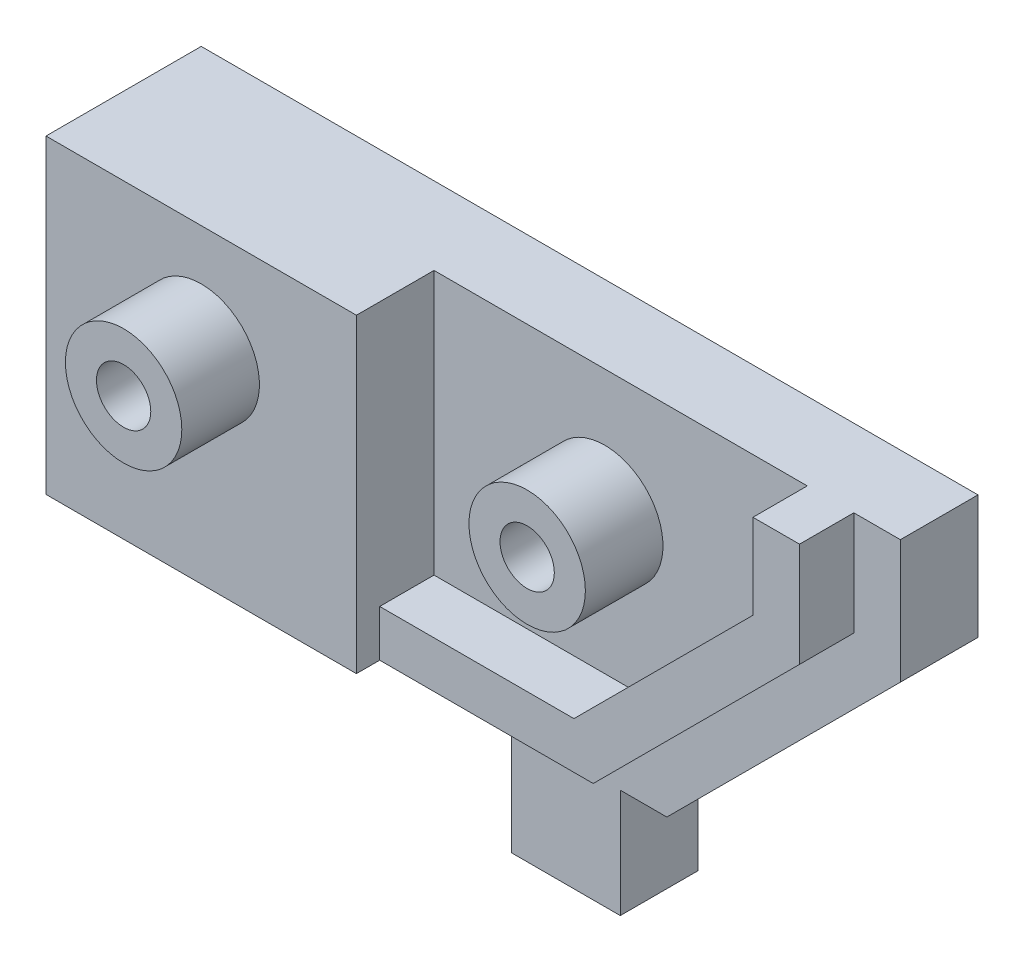
ISO-10303-21;
HEADER;
FILE_DESCRIPTION(('STEP AP214'),'2;1');
FILE_NAME('part.step','',(''),(''),'','','');
FILE_SCHEMA(('AUTOMOTIVE_DESIGN { 1 0 10303 214 1 1 1 1 }'));
ENDSEC;
DATA;
#1=APPLICATION_CONTEXT('core data for automotive mechanical design processes');
#2=APPLICATION_PROTOCOL_DEFINITION('international standard','automotive_design',2000,#1);
#3=PRODUCT_CONTEXT('',#1,'mechanical');
#4=PRODUCT('Part','Part','',(#3));
#5=PRODUCT_RELATED_PRODUCT_CATEGORY('part','',(#4));
#6=PRODUCT_DEFINITION_FORMATION('','',#4);
#7=PRODUCT_DEFINITION_CONTEXT('part definition',#1,'design');
#8=PRODUCT_DEFINITION('design','',#6,#7);
#9=PRODUCT_DEFINITION_SHAPE('','',#8);
#10=(LENGTH_UNIT() NAMED_UNIT(*) SI_UNIT(.MILLI.,.METRE.));
#11=(NAMED_UNIT(*) PLANE_ANGLE_UNIT() SI_UNIT($,.RADIAN.));
#12=(NAMED_UNIT(*) SI_UNIT($,.STERADIAN.) SOLID_ANGLE_UNIT());
#13=UNCERTAINTY_MEASURE_WITH_UNIT(LENGTH_MEASURE(1.E-05),#10,'distance_accuracy_value','');
#14=(GEOMETRIC_REPRESENTATION_CONTEXT(3) GLOBAL_UNCERTAINTY_ASSIGNED_CONTEXT((#13)) GLOBAL_UNIT_ASSIGNED_CONTEXT((#10,
#11,#12)) REPRESENTATION_CONTEXT('',''));
#15=CARTESIAN_POINT('',(0.,0.,0.));
#16=DIRECTION('',(0.,0.,1.));
#17=DIRECTION('',(1.,0.,0.));
#18=AXIS2_PLACEMENT_3D('',#15,#16,#17);
#19=CARTESIAN_POINT('',(-35.,23.,5.));
#20=DIRECTION('',(1.,0.,0.));
#21=DIRECTION('',(0.,0.,-1.));
#22=AXIS2_PLACEMENT_3D('',#19,#20,#21);
#23=PLANE('',#22);
#24=DIRECTION('',(0.,1.,0.));
#25=VECTOR('',#24,1.);
#26=CARTESIAN_POINT('',(-35.,3.,5.00000000000001));
#27=LINE('',#26,#25);
#28=CARTESIAN_POINT('',(-35.,0.,5.00000000000001));
#29=VERTEX_POINT('',#28);
#30=CARTESIAN_POINT('',(-35.,3.,5.00000000000001));
#31=VERTEX_POINT('',#30);
#32=EDGE_CURVE('E201',#29,#31,#27,.T.);
#33=ORIENTED_EDGE('',*,*,#32,.T.);
#34=DIRECTION('',(0.,0.,-1.));
#35=VECTOR('',#34,1.);
#36=CARTESIAN_POINT('',(-35.,3.,5.00000000000001));
#37=LINE('',#36,#35);
#38=CARTESIAN_POINT('',(-35.,3.,10.));
#39=VERTEX_POINT('',#38);
#40=EDGE_CURVE('E246',#39,#31,#37,.T.);
#41=ORIENTED_EDGE('',*,*,#40,.F.);
#42=DIRECTION('',(0.,-1.,0.));
#43=VECTOR('',#42,1.);
#44=CARTESIAN_POINT('',(-35.,23.,10.));
#45=LINE('',#44,#43);
#46=CARTESIAN_POINT('',(-35.,23.,10.));
#47=VERTEX_POINT('',#46);
#48=EDGE_CURVE('E199',#47,#39,#45,.T.);
#49=ORIENTED_EDGE('',*,*,#48,.F.);
#50=DIRECTION('',(0.,0.,1.));
#51=VECTOR('',#50,1.);
#52=CARTESIAN_POINT('',(-35.,23.,5.));
#53=LINE('',#52,#51);
#54=CARTESIAN_POINT('',(-35.,23.,0.));
#55=VERTEX_POINT('',#54);
#56=EDGE_CURVE('E417',#55,#47,#53,.T.);
#57=ORIENTED_EDGE('',*,*,#56,.F.);
#58=DIRECTION('',(0.,-1.,0.));
#59=VECTOR('',#58,1.);
#60=CARTESIAN_POINT('',(-35.,23.,0.));
#61=LINE('',#60,#59);
#62=CARTESIAN_POINT('',(-35.,0.,0.));
#63=VERTEX_POINT('',#62);
#64=EDGE_CURVE('E211',#55,#63,#61,.T.);
#65=ORIENTED_EDGE('',*,*,#64,.T.);
#66=DIRECTION('',(0.,0.,1.));
#67=VECTOR('',#66,1.);
#68=CARTESIAN_POINT('',(-35.,0.,5.));
#69=LINE('',#68,#67);
#70=EDGE_CURVE('E248',#63,#29,#69,.T.);
#71=ORIENTED_EDGE('',*,*,#70,.T.);
#72=EDGE_LOOP('',(#33,#41,#49,#57,#65,#71));
#73=FACE_BOUND('',#72,.T.);
#74=ADVANCED_FACE('F44',(#73),#23,.F.);
#75=CARTESIAN_POINT('',(0.,0.,0.));
#76=DIRECTION('',(0.,-1.,0.));
#77=DIRECTION('',(0.,0.,-1.));
#78=AXIS2_PLACEMENT_3D('',#75,#76,#77);
#79=PLANE('',#78);
#80=CARTESIAN_POINT('',(-25.,0.,2.5));
#81=DIRECTION('',(0.,-1.,0.));
#82=DIRECTION('',(0.,0.,-1.));
#83=AXIS2_PLACEMENT_3D('',#80,#81,#82);
#84=CIRCLE('',#83,1.5);
#85=CARTESIAN_POINT('',(-25.,0.,0.999999999999999));
#86=VERTEX_POINT('',#85);
#87=EDGE_CURVE('E397',#86,#86,#84,.T.);
#88=ORIENTED_EDGE('',*,*,#87,.F.);
#89=EDGE_LOOP('',(#88));
#90=FACE_BOUND('',#89,.T.);
#91=DIRECTION('',(1.,0.,0.));
#92=VECTOR('',#91,1.);
#93=CARTESIAN_POINT('',(0.,0.,5.));
#94=LINE('',#93,#92);
#95=CARTESIAN_POINT('',(-10.,0.,5.));
#96=VERTEX_POINT('',#95);
#97=EDGE_CURVE('E418',#29,#96,#94,.T.);
#98=ORIENTED_EDGE('',*,*,#97,.F.);
#99=ORIENTED_EDGE('',*,*,#70,.F.);
#100=DIRECTION('',(-1.,0.,0.));
#101=VECTOR('',#100,1.);
#102=CARTESIAN_POINT('',(-35.,0.,0.));
#103=LINE('',#102,#101);
#104=CARTESIAN_POINT('',(-10.,0.,0.));
#105=VERTEX_POINT('',#104);
#106=EDGE_CURVE('E433',#105,#63,#103,.T.);
#107=ORIENTED_EDGE('',*,*,#106,.F.);
#108=DIRECTION('',(0.,0.,-1.));
#109=VECTOR('',#108,1.);
#110=CARTESIAN_POINT('',(-10.,0.,0.));
#111=LINE('',#110,#109);
#112=EDGE_CURVE('E367',#96,#105,#111,.T.);
#113=ORIENTED_EDGE('',*,*,#112,.F.);
#114=EDGE_LOOP('',(#98,#99,#107,#113));
#115=FACE_BOUND('',#114,.T.);
#116=ADVANCED_FACE('F233',(#90,#115),#79,.T.);
#117=CARTESIAN_POINT('',(0.,23.,5.));
#118=DIRECTION('',(0.,0.,-1.));
#119=DIRECTION('',(-1.,0.,0.));
#120=AXIS2_PLACEMENT_3D('',#117,#118,#119);
#121=PLANE('',#120);
#122=CARTESIAN_POINT('',(-4.,15.,5.));
#123=DIRECTION('',(0.,0.,-1.));
#124=DIRECTION('',(-1.,0.,0.));
#125=AXIS2_PLACEMENT_3D('',#122,#123,#124);
#126=CIRCLE('',#125,3.75);
#127=CARTESIAN_POINT('',(-7.75,15.,5.));
#128=VERTEX_POINT('',#127);
#129=EDGE_CURVE('E11',#128,#128,#126,.F.);
#130=ORIENTED_EDGE('',*,*,#129,.F.);
#131=EDGE_LOOP('',(#130));
#132=FACE_BOUND('',#131,.T.);
#133=DIRECTION('',(0.,-1.,0.));
#134=VECTOR('',#133,1.);
#135=CARTESIAN_POINT('',(9.04723230364965,23.,5.));
#136=LINE('',#135,#134);
#137=CARTESIAN_POINT('',(9.04723230364965,23.,5.));
#138=VERTEX_POINT('',#137);
#139=CARTESIAN_POINT('',(9.04723230364965,17.5325136778882,5.));
#140=VERTEX_POINT('',#139);
#141=EDGE_CURVE('E254',#138,#140,#136,.T.);
#142=ORIENTED_EDGE('',*,*,#141,.F.);
#143=DIRECTION('',(1.,0.,0.));
#144=VECTOR('',#143,1.);
#145=CARTESIAN_POINT('',(0.,23.,5.));
#146=LINE('',#145,#144);
#147=CARTESIAN_POINT('',(-15.,23.,5.));
#148=VERTEX_POINT('',#147);
#149=EDGE_CURVE('E214',#148,#138,#146,.T.);
#150=ORIENTED_EDGE('',*,*,#149,.F.);
#151=DIRECTION('',(0.,-1.,0.));
#152=VECTOR('',#151,1.);
#153=CARTESIAN_POINT('',(-15.,23.,5.));
#154=LINE('',#153,#152);
#155=CARTESIAN_POINT('',(-15.,6.,5.));
#156=VERTEX_POINT('',#155);
#157=EDGE_CURVE('E207',#148,#156,#154,.T.);
#158=ORIENTED_EDGE('',*,*,#157,.T.);
#159=DIRECTION('',(-1.,0.,0.));
#160=VECTOR('',#159,1.);
#161=CARTESIAN_POINT('',(-2.48528137423857,6.,5.));
#162=LINE('',#161,#160);
#163=CARTESIAN_POINT('',(-2.48528137423857,6.,5.));
#164=VERTEX_POINT('',#163);
#165=EDGE_CURVE('E287',#164,#156,#162,.T.);
#166=ORIENTED_EDGE('',*,*,#165,.F.);
#167=DIRECTION('',(-0.707106781186548,-0.707106781186547,0.));
#168=VECTOR('',#167,1.);
#169=CARTESIAN_POINT('',(9.04723230364965,17.5325136778882,5.));
#170=LINE('',#169,#168);
#171=EDGE_CURVE('E284',#140,#164,#170,.T.);
#172=ORIENTED_EDGE('',*,*,#171,.F.);
#173=EDGE_LOOP('',(#142,#150,#158,#166,#172));
#174=FACE_BOUND('',#173,.T.);
#175=ADVANCED_FACE('F241',(#132,#174),#121,.F.);
#176=DIRECTION('',(1.,0.,0.));
#177=VECTOR('',#176,1.);
#178=CARTESIAN_POINT('',(-1.24264068711928,3.,5.));
#179=LINE('',#178,#177);
#180=CARTESIAN_POINT('',(-1.24264068711928,3.,5.));
#181=VERTEX_POINT('',#180);
#182=EDGE_CURVE('E290',#31,#181,#179,.T.);
#183=ORIENTED_EDGE('',*,*,#182,.F.);
#184=ORIENTED_EDGE('',*,*,#32,.F.);
#185=ORIENTED_EDGE('',*,*,#97,.T.);
#186=DIRECTION('',(0.,1.,0.));
#187=VECTOR('',#186,1.);
#188=CARTESIAN_POINT('',(-10.,-7.,5.));
#189=LINE('',#188,#187);
#190=CARTESIAN_POINT('',(-10.,-7.,5.));
#191=VERTEX_POINT('',#190);
#192=EDGE_CURVE('E389',#191,#96,#189,.T.);
#193=ORIENTED_EDGE('',*,*,#192,.F.);
#194=DIRECTION('',(-1.,0.,0.));
#195=VECTOR('',#194,1.);
#196=CARTESIAN_POINT('',(-10.,-7.,5.));
#197=LINE('',#196,#195);
#198=CARTESIAN_POINT('',(-3.,-7.,5.));
#199=VERTEX_POINT('',#198);
#200=EDGE_CURVE('E366',#199,#191,#197,.T.);
#201=ORIENTED_EDGE('',*,*,#200,.F.);
#202=DIRECTION('',(0.,1.,0.));
#203=VECTOR('',#202,1.);
#204=CARTESIAN_POINT('',(-3.,-7.,5.));
#205=LINE('',#204,#203);
#206=CARTESIAN_POINT('',(-3.,0.,5.));
#207=VERTEX_POINT('',#206);
#208=EDGE_CURVE('E393',#199,#207,#205,.T.);
#209=ORIENTED_EDGE('',*,*,#208,.T.);
#210=CARTESIAN_POINT('',(0.,0.,5.));
#211=VERTEX_POINT('',#210);
#212=EDGE_CURVE('E438',#207,#211,#94,.T.);
#213=ORIENTED_EDGE('',*,*,#212,.T.);
#214=DIRECTION('',(0.707106781186544,0.707106781186551,0.));
#215=VECTOR('',#214,1.);
#216=CARTESIAN_POINT('',(15.0472323036496,15.0472323036498,5.));
#217=LINE('',#216,#215);
#218=CARTESIAN_POINT('',(15.0472323036496,15.0472323036498,5.));
#219=VERTEX_POINT('',#218);
#220=EDGE_CURVE('E323',#211,#219,#217,.T.);
#221=ORIENTED_EDGE('',*,*,#220,.T.);
#222=DIRECTION('',(0.,1.,0.));
#223=VECTOR('',#222,1.);
#224=CARTESIAN_POINT('',(15.0472323036496,23.,5.));
#225=LINE('',#224,#223);
#226=CARTESIAN_POINT('',(15.0472323036496,23.,5.));
#227=VERTEX_POINT('',#226);
#228=EDGE_CURVE('E329',#219,#227,#225,.T.);
#229=ORIENTED_EDGE('',*,*,#228,.T.);
#230=CARTESIAN_POINT('',(12.0472323036496,23.,5.));
#231=VERTEX_POINT('',#230);
#232=EDGE_CURVE('E426',#231,#227,#146,.T.);
#233=ORIENTED_EDGE('',*,*,#232,.F.);
#234=DIRECTION('',(0.,1.,0.));
#235=VECTOR('',#234,1.);
#236=CARTESIAN_POINT('',(12.0472323036496,23.,5.));
#237=LINE('',#236,#235);
#238=CARTESIAN_POINT('',(12.0472323036496,16.2898729907689,5.));
#239=VERTEX_POINT('',#238);
#240=EDGE_CURVE('E262',#239,#231,#237,.T.);
#241=ORIENTED_EDGE('',*,*,#240,.F.);
#242=DIRECTION('',(0.707106781186547,0.707106781186548,0.));
#243=VECTOR('',#242,1.);
#244=CARTESIAN_POINT('',(12.0472323036496,16.2898729907689,5.));
#245=LINE('',#244,#243);
#246=EDGE_CURVE('E293',#181,#239,#245,.T.);
#247=ORIENTED_EDGE('',*,*,#246,.F.);
#248=EDGE_LOOP('',(#183,#184,#185,#193,#201,#209,#213,#221,#229,#233,#241,#247));
#249=FACE_BOUND('',#248,.T.);
#250=ADVANCED_FACE('F234',(#249),#121,.F.);
#251=CARTESIAN_POINT('',(-15.,23.,5.));
#252=DIRECTION('',(-1.,0.,0.));
#253=DIRECTION('',(0.,0.,1.));
#254=AXIS2_PLACEMENT_3D('',#251,#252,#253);
#255=PLANE('',#254);
#256=DIRECTION('',(0.,-1.,0.));
#257=VECTOR('',#256,1.);
#258=CARTESIAN_POINT('',(-15.,23.,10.));
#259=LINE('',#258,#257);
#260=CARTESIAN_POINT('',(-15.,23.,10.));
#261=VERTEX_POINT('',#260);
#262=CARTESIAN_POINT('',(-15.,3.,10.));
#263=VERTEX_POINT('',#262);
#264=EDGE_CURVE('E196',#261,#263,#259,.T.);
#265=ORIENTED_EDGE('',*,*,#264,.T.);
#266=DIRECTION('',(0.,0.,1.));
#267=VECTOR('',#266,1.);
#268=CARTESIAN_POINT('',(-15.,3.,5.));
#269=LINE('',#268,#267);
#270=CARTESIAN_POINT('',(-15.,3.,8.5));
#271=VERTEX_POINT('',#270);
#272=EDGE_CURVE('E176',#271,#263,#269,.T.);
#273=ORIENTED_EDGE('',*,*,#272,.F.);
#274=DIRECTION('',(0.,-1.,0.));
#275=VECTOR('',#274,1.);
#276=CARTESIAN_POINT('',(-15.,6.,8.5));
#277=LINE('',#276,#275);
#278=CARTESIAN_POINT('',(-15.,6.,8.5));
#279=VERTEX_POINT('',#278);
#280=EDGE_CURVE('E271',#279,#271,#277,.T.);
#281=ORIENTED_EDGE('',*,*,#280,.F.);
#282=DIRECTION('',(0.,0.,-1.));
#283=VECTOR('',#282,1.);
#284=CARTESIAN_POINT('',(-15.,6.,8.5));
#285=LINE('',#284,#283);
#286=EDGE_CURVE('E308',#279,#156,#285,.T.);
#287=ORIENTED_EDGE('',*,*,#286,.T.);
#288=ORIENTED_EDGE('',*,*,#157,.F.);
#289=DIRECTION('',(0.,0.,-1.));
#290=VECTOR('',#289,1.);
#291=CARTESIAN_POINT('',(-15.,23.,5.));
#292=LINE('',#291,#290);
#293=EDGE_CURVE('E205',#261,#148,#292,.T.);
#294=ORIENTED_EDGE('',*,*,#293,.F.);
#295=EDGE_LOOP('',(#265,#273,#281,#287,#288,#294));
#296=FACE_BOUND('',#295,.T.);
#297=ADVANCED_FACE('F203',(#296),#255,.F.);
#298=CARTESIAN_POINT('',(-15.,23.,10.));
#299=DIRECTION('',(0.,0.,-1.));
#300=DIRECTION('',(-1.,0.,0.));
#301=AXIS2_PLACEMENT_3D('',#298,#299,#300);
#302=PLANE('',#301);
#303=ORIENTED_EDGE('',*,*,#48,.T.);
#304=DIRECTION('',(1.,0.,0.));
#305=VECTOR('',#304,1.);
#306=CARTESIAN_POINT('',(-40.8309518948453,3.,10.));
#307=LINE('',#306,#305);
#308=EDGE_CURVE('E180',#39,#263,#307,.T.);
#309=ORIENTED_EDGE('',*,*,#308,.T.);
#310=ORIENTED_EDGE('',*,*,#264,.F.);
#311=DIRECTION('',(1.,0.,0.));
#312=VECTOR('',#311,1.);
#313=CARTESIAN_POINT('',(-15.,23.,10.));
#314=LINE('',#313,#312);
#315=EDGE_CURVE('E421',#47,#261,#314,.T.);
#316=ORIENTED_EDGE('',*,*,#315,.F.);
#317=EDGE_LOOP('',(#303,#309,#310,#316));
#318=FACE_BOUND('',#317,.T.);
#319=CARTESIAN_POINT('',(-25.,16.,10.));
#320=DIRECTION('',(0.,0.,-1.));
#321=DIRECTION('',(-1.,0.,0.));
#322=AXIS2_PLACEMENT_3D('',#319,#320,#321);
#323=CIRCLE('',#322,3.75);
#324=CARTESIAN_POINT('',(-28.75,16.,10.));
#325=VERTEX_POINT('',#324);
#326=EDGE_CURVE('E53',#325,#325,#323,.F.);
#327=ORIENTED_EDGE('',*,*,#326,.F.);
#328=EDGE_LOOP('',(#327));
#329=FACE_BOUND('',#328,.T.);
#330=ADVANCED_FACE('F193',(#318,#329),#302,.F.);
#331=DIRECTION('',(0.,0.,1.));
#332=VECTOR('',#331,1.);
#333=CARTESIAN_POINT('',(-3.,0.,0.));
#334=LINE('',#333,#332);
#335=CARTESIAN_POINT('',(-3.,0.,0.));
#336=VERTEX_POINT('',#335);
#337=EDGE_CURVE('E68',#336,#207,#334,.T.);
#338=ORIENTED_EDGE('',*,*,#337,.F.);
#339=CARTESIAN_POINT('',(0.,0.,0.));
#340=VERTEX_POINT('',#339);
#341=EDGE_CURVE('E434',#340,#336,#103,.T.);
#342=ORIENTED_EDGE('',*,*,#341,.F.);
#343=DIRECTION('',(0.,0.,-1.));
#344=VECTOR('',#343,1.);
#345=CARTESIAN_POINT('',(0.,0.,0.));
#346=LINE('',#345,#344);
#347=EDGE_CURVE('E410',#211,#340,#346,.T.);
#348=ORIENTED_EDGE('',*,*,#347,.F.);
#349=ORIENTED_EDGE('',*,*,#212,.F.);
#350=EDGE_LOOP('',(#338,#342,#348,#349));
#351=FACE_BOUND('',#350,.T.);
#352=ADVANCED_FACE('F226',(#351),#79,.T.);
#353=CARTESIAN_POINT('',(-35.,23.,0.));
#354=DIRECTION('',(0.,0.,1.));
#355=DIRECTION('',(1.,0.,0.));
#356=AXIS2_PLACEMENT_3D('',#353,#354,#355);
#357=PLANE('',#356);
#358=CARTESIAN_POINT('',(-25.,16.,0.));
#359=DIRECTION('',(0.,0.,1.));
#360=DIRECTION('',(1.,0.,0.));
#361=AXIS2_PLACEMENT_3D('',#358,#359,#360);
#362=CIRCLE('',#361,1.75);
#363=CARTESIAN_POINT('',(-23.25,16.,0.));
#364=VERTEX_POINT('',#363);
#365=EDGE_CURVE('E406',#364,#364,#362,.T.);
#366=ORIENTED_EDGE('',*,*,#365,.T.);
#367=EDGE_LOOP('',(#366));
#368=FACE_BOUND('',#367,.T.);
#369=CARTESIAN_POINT('',(-4.,15.,0.));
#370=DIRECTION('',(0.,0.,1.));
#371=DIRECTION('',(1.,0.,0.));
#372=AXIS2_PLACEMENT_3D('',#369,#370,#371);
#373=CIRCLE('',#372,1.75);
#374=CARTESIAN_POINT('',(-2.25,15.,0.));
#375=VERTEX_POINT('',#374);
#376=EDGE_CURVE('E402',#375,#375,#373,.T.);
#377=ORIENTED_EDGE('',*,*,#376,.T.);
#378=EDGE_LOOP('',(#377));
#379=FACE_BOUND('',#378,.T.);
#380=ORIENTED_EDGE('',*,*,#341,.T.);
#381=DIRECTION('',(0.,1.,0.));
#382=VECTOR('',#381,1.);
#383=CARTESIAN_POINT('',(-3.,-7.,0.));
#384=LINE('',#383,#382);
#385=CARTESIAN_POINT('',(-3.,-7.,0.));
#386=VERTEX_POINT('',#385);
#387=EDGE_CURVE('E376',#386,#336,#384,.T.);
#388=ORIENTED_EDGE('',*,*,#387,.F.);
#389=DIRECTION('',(1.,0.,0.));
#390=VECTOR('',#389,1.);
#391=CARTESIAN_POINT('',(-10.,-7.,0.));
#392=LINE('',#391,#390);
#393=CARTESIAN_POINT('',(-10.,-7.,0.));
#394=VERTEX_POINT('',#393);
#395=EDGE_CURVE('E373',#394,#386,#392,.T.);
#396=ORIENTED_EDGE('',*,*,#395,.F.);
#397=DIRECTION('',(0.,1.,0.));
#398=VECTOR('',#397,1.);
#399=CARTESIAN_POINT('',(-10.,-7.,0.));
#400=LINE('',#399,#398);
#401=EDGE_CURVE('E385',#394,#105,#400,.T.);
#402=ORIENTED_EDGE('',*,*,#401,.T.);
#403=ORIENTED_EDGE('',*,*,#106,.T.);
#404=ORIENTED_EDGE('',*,*,#64,.F.);
#405=DIRECTION('',(-1.,0.,0.));
#406=VECTOR('',#405,1.);
#407=CARTESIAN_POINT('',(0.,23.,0.));
#408=LINE('',#407,#406);
#409=CARTESIAN_POINT('',(15.0472323036496,23.,0.));
#410=VERTEX_POINT('',#409);
#411=EDGE_CURVE('E414',#410,#55,#408,.T.);
#412=ORIENTED_EDGE('',*,*,#411,.F.);
#413=DIRECTION('',(0.,1.,0.));
#414=VECTOR('',#413,1.);
#415=CARTESIAN_POINT('',(15.0472323036496,23.,0.));
#416=LINE('',#415,#414);
#417=CARTESIAN_POINT('',(15.0472323036496,15.0472323036498,0.));
#418=VERTEX_POINT('',#417);
#419=EDGE_CURVE('E328',#418,#410,#416,.T.);
#420=ORIENTED_EDGE('',*,*,#419,.F.);
#421=DIRECTION('',(0.707106781186544,0.707106781186551,0.));
#422=VECTOR('',#421,1.);
#423=CARTESIAN_POINT('',(15.0472323036496,15.0472323036498,0.));
#424=LINE('',#423,#422);
#425=EDGE_CURVE('E324',#340,#418,#424,.T.);
#426=ORIENTED_EDGE('',*,*,#425,.F.);
#427=EDGE_LOOP('',(#380,#388,#396,#402,#403,#404,#412,#420,#426));
#428=FACE_BOUND('',#427,.T.);
#429=ADVANCED_FACE('F46',(#368,#379,#428),#357,.F.);
#430=CARTESIAN_POINT('',(0.,23.,0.));
#431=DIRECTION('',(0.,-1.,0.));
#432=DIRECTION('',(0.,0.,-1.));
#433=AXIS2_PLACEMENT_3D('',#430,#431,#432);
#434=PLANE('',#433);
#435=ORIENTED_EDGE('',*,*,#149,.T.);
#436=DIRECTION('',(0.,0.,-1.));
#437=VECTOR('',#436,1.);
#438=CARTESIAN_POINT('',(9.04723230364965,23.,8.5));
#439=LINE('',#438,#437);
#440=CARTESIAN_POINT('',(9.04723230364965,23.,8.5));
#441=VERTEX_POINT('',#440);
#442=EDGE_CURVE('E320',#441,#138,#439,.T.);
#443=ORIENTED_EDGE('',*,*,#442,.F.);
#444=DIRECTION('',(-1.,0.,0.));
#445=VECTOR('',#444,1.);
#446=CARTESIAN_POINT('',(9.04723230364965,23.,8.5));
#447=LINE('',#446,#445);
#448=CARTESIAN_POINT('',(12.0472323036496,23.,8.5));
#449=VERTEX_POINT('',#448);
#450=EDGE_CURVE('E257',#449,#441,#447,.T.);
#451=ORIENTED_EDGE('',*,*,#450,.F.);
#452=DIRECTION('',(0.,0.,-1.));
#453=VECTOR('',#452,1.);
#454=CARTESIAN_POINT('',(12.0472323036496,23.,8.5));
#455=LINE('',#454,#453);
#456=EDGE_CURVE('E60',#449,#231,#455,.T.);
#457=ORIENTED_EDGE('',*,*,#456,.T.);
#458=ORIENTED_EDGE('',*,*,#232,.T.);
#459=DIRECTION('',(0.,0.,1.));
#460=VECTOR('',#459,1.);
#461=CARTESIAN_POINT('',(15.0472323036496,23.,0.));
#462=LINE('',#461,#460);
#463=EDGE_CURVE('E340',#410,#227,#462,.T.);
#464=ORIENTED_EDGE('',*,*,#463,.F.);
#465=ORIENTED_EDGE('',*,*,#411,.T.);
#466=ORIENTED_EDGE('',*,*,#56,.T.);
#467=ORIENTED_EDGE('',*,*,#315,.T.);
#468=ORIENTED_EDGE('',*,*,#293,.T.);
#469=EDGE_LOOP('',(#435,#443,#451,#457,#458,#464,#465,#466,#467,#468));
#470=FACE_BOUND('',#469,.T.);
#471=ADVANCED_FACE('F457',(#470),#434,.F.);
#472=CARTESIAN_POINT('',(-4.,15.,0.));
#473=DIRECTION('',(0.,0.,1.));
#474=DIRECTION('',(1.,0.,0.));
#475=AXIS2_PLACEMENT_3D('',#472,#473,#474);
#476=CYLINDRICAL_SURFACE('',#475,1.75);
#477=ORIENTED_EDGE('',*,*,#376,.F.);
#478=EDGE_LOOP('',(#477));
#479=FACE_BOUND('',#478,.T.);
#480=CARTESIAN_POINT('',(-4.,15.,10.));
#481=DIRECTION('',(0.,0.,1.));
#482=DIRECTION('',(1.,0.,0.));
#483=AXIS2_PLACEMENT_3D('',#480,#481,#482);
#484=CIRCLE('',#483,1.75);
#485=CARTESIAN_POINT('',(-2.25,15.,10.));
#486=VERTEX_POINT('',#485);
#487=EDGE_CURVE('E344',#486,#486,#484,.T.);
#488=ORIENTED_EDGE('',*,*,#487,.T.);
#489=EDGE_LOOP('',(#488));
#490=FACE_BOUND('',#489,.T.);
#491=ADVANCED_FACE('F545',(#479,#490),#476,.F.);
#492=CARTESIAN_POINT('',(-25.,16.,0.));
#493=DIRECTION('',(0.,0.,1.));
#494=DIRECTION('',(1.,0.,0.));
#495=AXIS2_PLACEMENT_3D('',#492,#493,#494);
#496=CYLINDRICAL_SURFACE('',#495,1.75);
#497=ORIENTED_EDGE('',*,*,#365,.F.);
#498=EDGE_LOOP('',(#497));
#499=FACE_BOUND('',#498,.T.);
#500=CARTESIAN_POINT('',(-25.,16.,15.));
#501=DIRECTION('',(0.,0.,1.));
#502=DIRECTION('',(1.,0.,0.));
#503=AXIS2_PLACEMENT_3D('',#500,#501,#502);
#504=CIRCLE('',#503,1.75);
#505=CARTESIAN_POINT('',(-23.25,16.,15.));
#506=VERTEX_POINT('',#505);
#507=EDGE_CURVE('E354',#506,#506,#504,.T.);
#508=ORIENTED_EDGE('',*,*,#507,.T.);
#509=EDGE_LOOP('',(#508));
#510=FACE_BOUND('',#509,.T.);
#511=ADVANCED_FACE('F541',(#499,#510),#496,.F.);
#512=CARTESIAN_POINT('',(-25.,10.,2.5));
#513=DIRECTION('',(0.,-1.,0.));
#514=DIRECTION('',(0.,0.,-1.));
#515=AXIS2_PLACEMENT_3D('',#512,#513,#514);
#516=CYLINDRICAL_SURFACE('',#515,1.5);
#517=CARTESIAN_POINT('',(-25.,10.,2.5));
#518=DIRECTION('',(0.,-1.,0.));
#519=DIRECTION('',(0.,0.,-1.));
#520=AXIS2_PLACEMENT_3D('',#517,#518,#519);
#521=CIRCLE('',#520,1.5);
#522=CARTESIAN_POINT('',(-25.,10.,0.999999999999999));
#523=VERTEX_POINT('',#522);
#524=EDGE_CURVE('E398',#523,#523,#521,.T.);
#525=ORIENTED_EDGE('',*,*,#524,.F.);
#526=EDGE_LOOP('',(#525));
#527=FACE_BOUND('',#526,.T.);
#528=ORIENTED_EDGE('',*,*,#87,.T.);
#529=EDGE_LOOP('',(#528));
#530=FACE_BOUND('',#529,.T.);
#531=ADVANCED_FACE('F537',(#527,#530),#516,.F.);
#532=CARTESIAN_POINT('',(-25.,10.,2.5));
#533=DIRECTION('',(0.,-1.,0.));
#534=DIRECTION('',(0.,0.,-1.));
#535=AXIS2_PLACEMENT_3D('',#532,#533,#534);
#536=PLANE('',#535);
#537=ORIENTED_EDGE('',*,*,#524,.T.);
#538=EDGE_LOOP('',(#537));
#539=FACE_BOUND('',#538,.T.);
#540=ADVANCED_FACE('F533',(#539),#536,.T.);
#541=CARTESIAN_POINT('',(-3.,-7.,0.));
#542=DIRECTION('',(-1.,0.,0.));
#543=DIRECTION('',(0.,0.,1.));
#544=AXIS2_PLACEMENT_3D('',#541,#542,#543);
#545=PLANE('',#544);
#546=ORIENTED_EDGE('',*,*,#337,.T.);
#547=ORIENTED_EDGE('',*,*,#208,.F.);
#548=DIRECTION('',(0.,0.,1.));
#549=VECTOR('',#548,1.);
#550=CARTESIAN_POINT('',(-3.,-7.,0.));
#551=LINE('',#550,#549);
#552=EDGE_CURVE('E362',#386,#199,#551,.T.);
#553=ORIENTED_EDGE('',*,*,#552,.F.);
#554=ORIENTED_EDGE('',*,*,#387,.T.);
#555=EDGE_LOOP('',(#546,#547,#553,#554));
#556=FACE_BOUND('',#555,.T.);
#557=ADVANCED_FACE('F529',(#556),#545,.F.);
#558=CARTESIAN_POINT('',(-10.,-7.,0.));
#559=DIRECTION('',(1.,0.,0.));
#560=DIRECTION('',(0.,0.,-1.));
#561=AXIS2_PLACEMENT_3D('',#558,#559,#560);
#562=PLANE('',#561);
#563=ORIENTED_EDGE('',*,*,#112,.T.);
#564=ORIENTED_EDGE('',*,*,#401,.F.);
#565=DIRECTION('',(0.,0.,-1.));
#566=VECTOR('',#565,1.);
#567=CARTESIAN_POINT('',(-10.,-7.,0.));
#568=LINE('',#567,#566);
#569=EDGE_CURVE('E370',#191,#394,#568,.T.);
#570=ORIENTED_EDGE('',*,*,#569,.F.);
#571=ORIENTED_EDGE('',*,*,#192,.T.);
#572=EDGE_LOOP('',(#563,#564,#570,#571));
#573=FACE_BOUND('',#572,.T.);
#574=ADVANCED_FACE('F525',(#573),#562,.F.);
#575=CARTESIAN_POINT('',(0.,-7.,0.));
#576=DIRECTION('',(0.,1.,0.));
#577=DIRECTION('',(0.,0.,1.));
#578=AXIS2_PLACEMENT_3D('',#575,#576,#577);
#579=PLANE('',#578);
#580=ORIENTED_EDGE('',*,*,#552,.T.);
#581=ORIENTED_EDGE('',*,*,#200,.T.);
#582=ORIENTED_EDGE('',*,*,#569,.T.);
#583=ORIENTED_EDGE('',*,*,#395,.T.);
#584=EDGE_LOOP('',(#580,#581,#582,#583));
#585=FACE_BOUND('',#584,.T.);
#586=ADVANCED_FACE('F518',(#585),#579,.F.);
#587=CARTESIAN_POINT('',(-25.,16.,15.));
#588=DIRECTION('',(0.,0.,1.));
#589=DIRECTION('',(1.,0.,0.));
#590=AXIS2_PLACEMENT_3D('',#587,#588,#589);
#591=PLANE('',#590);
#592=CARTESIAN_POINT('',(-25.,16.,15.));
#593=DIRECTION('',(0.,0.,1.));
#594=DIRECTION('',(1.,0.,0.));
#595=AXIS2_PLACEMENT_3D('',#592,#593,#594);
#596=CIRCLE('',#595,3.75);
#597=CARTESIAN_POINT('',(-21.25,16.,15.));
#598=VERTEX_POINT('',#597);
#599=EDGE_CURVE('E358',#598,#598,#596,.T.);
#600=ORIENTED_EDGE('',*,*,#599,.T.);
#601=EDGE_LOOP('',(#600));
#602=FACE_BOUND('',#601,.T.);
#603=ORIENTED_EDGE('',*,*,#507,.F.);
#604=EDGE_LOOP('',(#603));
#605=FACE_BOUND('',#604,.T.);
#606=ADVANCED_FACE('F515',(#602,#605),#591,.T.);
#607=CARTESIAN_POINT('',(-25.,16.,15.));
#608=DIRECTION('',(0.,0.,-1.));
#609=DIRECTION('',(-1.,0.,0.));
#610=AXIS2_PLACEMENT_3D('',#607,#608,#609);
#611=CYLINDRICAL_SURFACE('',#610,3.75);
#612=ORIENTED_EDGE('',*,*,#599,.F.);
#613=EDGE_LOOP('',(#612));
#614=FACE_BOUND('',#613,.T.);
#615=ORIENTED_EDGE('',*,*,#326,.T.);
#616=EDGE_LOOP('',(#615));
#617=FACE_BOUND('',#616,.T.);
#618=ADVANCED_FACE('F224',(#614,#617),#611,.T.);
#619=CARTESIAN_POINT('',(-4.,15.,10.));
#620=DIRECTION('',(0.,0.,1.));
#621=DIRECTION('',(1.,0.,0.));
#622=AXIS2_PLACEMENT_3D('',#619,#620,#621);
#623=PLANE('',#622);
#624=CARTESIAN_POINT('',(-4.,15.,10.));
#625=DIRECTION('',(0.,0.,1.));
#626=DIRECTION('',(1.,0.,0.));
#627=AXIS2_PLACEMENT_3D('',#624,#625,#626);
#628=CIRCLE('',#627,3.75);
#629=CARTESIAN_POINT('',(-0.25,15.,10.));
#630=VERTEX_POINT('',#629);
#631=EDGE_CURVE('E350',#630,#630,#628,.T.);
#632=ORIENTED_EDGE('',*,*,#631,.T.);
#633=EDGE_LOOP('',(#632));
#634=FACE_BOUND('',#633,.T.);
#635=ORIENTED_EDGE('',*,*,#487,.F.);
#636=EDGE_LOOP('',(#635));
#637=FACE_BOUND('',#636,.T.);
#638=ADVANCED_FACE('F508',(#634,#637),#623,.T.);
#639=CARTESIAN_POINT('',(-4.,15.,10.));
#640=DIRECTION('',(0.,0.,-1.));
#641=DIRECTION('',(-1.,0.,0.));
#642=AXIS2_PLACEMENT_3D('',#639,#640,#641);
#643=CYLINDRICAL_SURFACE('',#642,3.75);
#644=ORIENTED_EDGE('',*,*,#631,.F.);
#645=EDGE_LOOP('',(#644));
#646=FACE_BOUND('',#645,.T.);
#647=ORIENTED_EDGE('',*,*,#129,.T.);
#648=EDGE_LOOP('',(#647));
#649=FACE_BOUND('',#648,.T.);
#650=ADVANCED_FACE('F507',(#646,#649),#643,.T.);
#651=CARTESIAN_POINT('',(15.0472323036496,15.0472323036498,0.));
#652=DIRECTION('',(0.707106781186551,-0.707106781186544,0.));
#653=DIRECTION('',(0.707106781186544,0.707106781186551,0.));
#654=AXIS2_PLACEMENT_3D('',#651,#652,#653);
#655=PLANE('',#654);
#656=ORIENTED_EDGE('',*,*,#220,.F.);
#657=ORIENTED_EDGE('',*,*,#347,.T.);
#658=ORIENTED_EDGE('',*,*,#425,.T.);
#659=DIRECTION('',(0.,0.,1.));
#660=VECTOR('',#659,1.);
#661=CARTESIAN_POINT('',(15.0472323036496,15.0472323036498,0.));
#662=LINE('',#661,#660);
#663=EDGE_CURVE('E333',#418,#219,#662,.T.);
#664=ORIENTED_EDGE('',*,*,#663,.T.);
#665=EDGE_LOOP('',(#656,#657,#658,#664));
#666=FACE_BOUND('',#665,.T.);
#667=ADVANCED_FACE('F446',(#666),#655,.T.);
#668=CARTESIAN_POINT('',(15.0472323036496,23.,0.));
#669=DIRECTION('',(1.,0.,0.));
#670=DIRECTION('',(0.,1.,0.));
#671=AXIS2_PLACEMENT_3D('',#668,#669,#670);
#672=PLANE('',#671);
#673=ORIENTED_EDGE('',*,*,#228,.F.);
#674=ORIENTED_EDGE('',*,*,#663,.F.);
#675=ORIENTED_EDGE('',*,*,#419,.T.);
#676=ORIENTED_EDGE('',*,*,#463,.T.);
#677=EDGE_LOOP('',(#673,#674,#675,#676));
#678=FACE_BOUND('',#677,.T.);
#679=ADVANCED_FACE('F451',(#678),#672,.T.);
#680=CARTESIAN_POINT('',(9.04723230364965,23.,8.5));
#681=DIRECTION('',(1.,0.,0.));
#682=DIRECTION('',(0.,0.,-1.));
#683=AXIS2_PLACEMENT_3D('',#680,#681,#682);
#684=PLANE('',#683);
#685=ORIENTED_EDGE('',*,*,#141,.T.);
#686=DIRECTION('',(0.,0.,-1.));
#687=VECTOR('',#686,1.);
#688=CARTESIAN_POINT('',(9.04723230364965,17.5325136778882,8.5));
#689=LINE('',#688,#687);
#690=CARTESIAN_POINT('',(9.04723230364965,17.5325136778882,8.5));
#691=VERTEX_POINT('',#690);
#692=EDGE_CURVE('E316',#691,#140,#689,.T.);
#693=ORIENTED_EDGE('',*,*,#692,.F.);
#694=DIRECTION('',(0.,-1.,0.));
#695=VECTOR('',#694,1.);
#696=CARTESIAN_POINT('',(9.04723230364965,23.,8.5));
#697=LINE('',#696,#695);
#698=EDGE_CURVE('E261',#441,#691,#697,.T.);
#699=ORIENTED_EDGE('',*,*,#698,.F.);
#700=ORIENTED_EDGE('',*,*,#442,.T.);
#701=EDGE_LOOP('',(#685,#693,#699,#700));
#702=FACE_BOUND('',#701,.T.);
#703=ADVANCED_FACE('F470',(#702),#684,.F.);
#704=CARTESIAN_POINT('',(9.04723230364965,17.5325136778882,8.5));
#705=DIRECTION('',(0.707106781186548,-0.707106781186548,0.));
#706=DIRECTION('',(0.707106781186548,0.707106781186547,0.));
#707=AXIS2_PLACEMENT_3D('',#704,#705,#706);
#708=PLANE('',#707);
#709=ORIENTED_EDGE('',*,*,#171,.T.);
#710=DIRECTION('',(0.,0.,-1.));
#711=VECTOR('',#710,1.);
#712=CARTESIAN_POINT('',(-2.48528137423857,6.,8.5));
#713=LINE('',#712,#711);
#714=CARTESIAN_POINT('',(-2.48528137423857,6.,8.5));
#715=VERTEX_POINT('',#714);
#716=EDGE_CURVE('E312',#715,#164,#713,.T.);
#717=ORIENTED_EDGE('',*,*,#716,.F.);
#718=DIRECTION('',(-0.707106781186548,-0.707106781186547,0.));
#719=VECTOR('',#718,1.);
#720=CARTESIAN_POINT('',(9.04723230364965,17.5325136778882,8.5));
#721=LINE('',#720,#719);
#722=EDGE_CURVE('E265',#691,#715,#721,.T.);
#723=ORIENTED_EDGE('',*,*,#722,.F.);
#724=ORIENTED_EDGE('',*,*,#692,.T.);
#725=EDGE_LOOP('',(#709,#717,#723,#724));
#726=FACE_BOUND('',#725,.T.);
#727=ADVANCED_FACE('F473',(#726),#708,.F.);
#728=CARTESIAN_POINT('',(-2.48528137423857,6.,8.5));
#729=DIRECTION('',(0.,-1.,0.));
#730=DIRECTION('',(1.,0.,0.));
#731=AXIS2_PLACEMENT_3D('',#728,#729,#730);
#732=PLANE('',#731);
#733=ORIENTED_EDGE('',*,*,#165,.T.);
#734=ORIENTED_EDGE('',*,*,#286,.F.);
#735=DIRECTION('',(-1.,0.,0.));
#736=VECTOR('',#735,1.);
#737=CARTESIAN_POINT('',(-2.48528137423857,6.,8.5));
#738=LINE('',#737,#736);
#739=EDGE_CURVE('E268',#715,#279,#738,.T.);
#740=ORIENTED_EDGE('',*,*,#739,.F.);
#741=ORIENTED_EDGE('',*,*,#716,.T.);
#742=EDGE_LOOP('',(#733,#734,#740,#741));
#743=FACE_BOUND('',#742,.T.);
#744=ADVANCED_FACE('F492',(#743),#732,.F.);
#745=CARTESIAN_POINT('',(-1.24264068711928,3.,8.5));
#746=DIRECTION('',(0.,1.,0.));
#747=DIRECTION('',(0.,0.,1.));
#748=AXIS2_PLACEMENT_3D('',#745,#746,#747);
#749=PLANE('',#748);
#750=ORIENTED_EDGE('',*,*,#182,.T.);
#751=DIRECTION('',(0.,0.,-1.));
#752=VECTOR('',#751,1.);
#753=CARTESIAN_POINT('',(-1.24264068711928,3.,8.5));
#754=LINE('',#753,#752);
#755=CARTESIAN_POINT('',(-1.24264068711928,3.,8.5));
#756=VERTEX_POINT('',#755);
#757=EDGE_CURVE('E304',#756,#181,#754,.T.);
#758=ORIENTED_EDGE('',*,*,#757,.F.);
#759=DIRECTION('',(1.,0.,0.));
#760=VECTOR('',#759,1.);
#761=CARTESIAN_POINT('',(-1.24264068711928,3.,8.5));
#762=LINE('',#761,#760);
#763=EDGE_CURVE('E183',#271,#756,#762,.T.);
#764=ORIENTED_EDGE('',*,*,#763,.F.);
#765=ORIENTED_EDGE('',*,*,#272,.T.);
#766=ORIENTED_EDGE('',*,*,#308,.F.);
#767=ORIENTED_EDGE('',*,*,#40,.T.);
#768=EDGE_LOOP('',(#750,#758,#764,#765,#766,#767));
#769=FACE_BOUND('',#768,.T.);
#770=ADVANCED_FACE('F178',(#769),#749,.F.);
#771=CARTESIAN_POINT('',(12.0472323036496,16.2898729907689,8.5));
#772=DIRECTION('',(-0.707106781186548,0.707106781186547,0.));
#773=DIRECTION('',(-0.707106781186547,-0.707106781186548,0.));
#774=AXIS2_PLACEMENT_3D('',#771,#772,#773);
#775=PLANE('',#774);
#776=ORIENTED_EDGE('',*,*,#246,.T.);
#777=DIRECTION('',(0.,0.,-1.));
#778=VECTOR('',#777,1.);
#779=CARTESIAN_POINT('',(12.0472323036496,16.2898729907689,8.5));
#780=LINE('',#779,#778);
#781=CARTESIAN_POINT('',(12.0472323036496,16.2898729907689,8.5));
#782=VERTEX_POINT('',#781);
#783=EDGE_CURVE('E300',#782,#239,#780,.T.);
#784=ORIENTED_EDGE('',*,*,#783,.F.);
#785=DIRECTION('',(0.707106781186547,0.707106781186548,0.));
#786=VECTOR('',#785,1.);
#787=CARTESIAN_POINT('',(12.0472323036496,16.2898729907689,8.5));
#788=LINE('',#787,#786);
#789=EDGE_CURVE('E276',#756,#782,#788,.T.);
#790=ORIENTED_EDGE('',*,*,#789,.F.);
#791=ORIENTED_EDGE('',*,*,#757,.T.);
#792=EDGE_LOOP('',(#776,#784,#790,#791));
#793=FACE_BOUND('',#792,.T.);
#794=ADVANCED_FACE('F484',(#793),#775,.F.);
#795=CARTESIAN_POINT('',(12.0472323036496,23.,8.5));
#796=DIRECTION('',(-1.,0.,0.));
#797=DIRECTION('',(0.,0.,1.));
#798=AXIS2_PLACEMENT_3D('',#795,#796,#797);
#799=PLANE('',#798);
#800=ORIENTED_EDGE('',*,*,#240,.T.);
#801=ORIENTED_EDGE('',*,*,#456,.F.);
#802=DIRECTION('',(0.,1.,0.));
#803=VECTOR('',#802,1.);
#804=CARTESIAN_POINT('',(12.0472323036496,23.,8.5));
#805=LINE('',#804,#803);
#806=EDGE_CURVE('E279',#782,#449,#805,.T.);
#807=ORIENTED_EDGE('',*,*,#806,.F.);
#808=ORIENTED_EDGE('',*,*,#783,.T.);
#809=EDGE_LOOP('',(#800,#801,#807,#808));
#810=FACE_BOUND('',#809,.T.);
#811=ADVANCED_FACE('F482',(#810),#799,.F.);
#812=CARTESIAN_POINT('',(0.,0.,8.5));
#813=DIRECTION('',(0.,0.,-1.));
#814=DIRECTION('',(-1.,0.,0.));
#815=AXIS2_PLACEMENT_3D('',#812,#813,#814);
#816=PLANE('',#815);
#817=ORIENTED_EDGE('',*,*,#450,.T.);
#818=ORIENTED_EDGE('',*,*,#698,.T.);
#819=ORIENTED_EDGE('',*,*,#722,.T.);
#820=ORIENTED_EDGE('',*,*,#739,.T.);
#821=ORIENTED_EDGE('',*,*,#280,.T.);
#822=ORIENTED_EDGE('',*,*,#763,.T.);
#823=ORIENTED_EDGE('',*,*,#789,.T.);
#824=ORIENTED_EDGE('',*,*,#806,.T.);
#825=EDGE_LOOP('',(#817,#818,#819,#820,#821,#822,#823,#824));
#826=FACE_BOUND('',#825,.T.);
#827=ADVANCED_FACE('F477',(#826),#816,.F.);
#828=CLOSED_SHELL('',(#74,#116,#175,#250,#297,#330,#352,#429,#471,#491,#511,#531,#540,#557,#574,
#586,#606,#618,#638,#650,#667,#679,#703,#727,#744,#770,#794,#811,#827));
#829=MANIFOLD_SOLID_BREP('B2',#828);
#830=ADVANCED_BREP_SHAPE_REPRESENTATION('',(#18,#829),#14);
#831=SHAPE_DEFINITION_REPRESENTATION(#9,#830);
ENDSEC;
END-ISO-10303-21;
